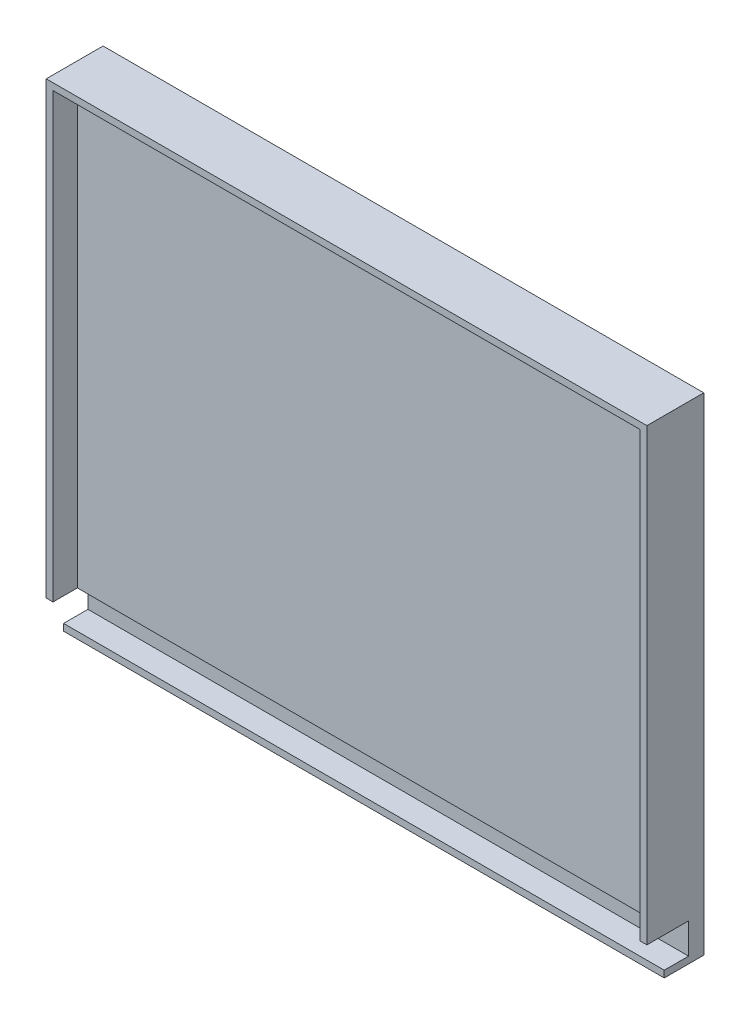
ISO-10303-21;
HEADER;
FILE_DESCRIPTION(('STEP AP214'),'2;1');
FILE_NAME('part.step','',(''),(''),'','','');
FILE_SCHEMA(('AUTOMOTIVE_DESIGN { 1 0 10303 214 1 1 1 1 }'));
ENDSEC;
DATA;
#1=APPLICATION_CONTEXT('core data for automotive mechanical design processes');
#2=APPLICATION_PROTOCOL_DEFINITION('international standard','automotive_design',2000,#1);
#3=PRODUCT_CONTEXT('',#1,'mechanical');
#4=PRODUCT('Part','Part','',(#3));
#5=PRODUCT_RELATED_PRODUCT_CATEGORY('part','',(#4));
#6=PRODUCT_DEFINITION_FORMATION('','',#4);
#7=PRODUCT_DEFINITION_CONTEXT('part definition',#1,'design');
#8=PRODUCT_DEFINITION('design','',#6,#7);
#9=PRODUCT_DEFINITION_SHAPE('','',#8);
#10=(LENGTH_UNIT() NAMED_UNIT(*) SI_UNIT(.MILLI.,.METRE.));
#11=(NAMED_UNIT(*) PLANE_ANGLE_UNIT() SI_UNIT($,.RADIAN.));
#12=(NAMED_UNIT(*) SI_UNIT($,.STERADIAN.) SOLID_ANGLE_UNIT());
#13=UNCERTAINTY_MEASURE_WITH_UNIT(LENGTH_MEASURE(1.E-05),#10,'distance_accuracy_value','');
#14=(GEOMETRIC_REPRESENTATION_CONTEXT(3) GLOBAL_UNCERTAINTY_ASSIGNED_CONTEXT((#13)) GLOBAL_UNIT_ASSIGNED_CONTEXT((#10,
#11,#12)) REPRESENTATION_CONTEXT('',''));
#15=CARTESIAN_POINT('',(0.,0.,0.));
#16=DIRECTION('',(0.,0.,1.));
#17=DIRECTION('',(1.,0.,0.));
#18=AXIS2_PLACEMENT_3D('',#15,#16,#17);
#19=CARTESIAN_POINT('',(-68.3631707317073,-94.7853658536585,17.272));
#20=DIRECTION('',(-1.,0.,0.));
#21=DIRECTION('',(0.,0.,1.));
#22=AXIS2_PLACEMENT_3D('',#19,#20,#21);
#23=PLANE('',#22);
#24=DIRECTION('',(0.,0.,-1.));
#25=VECTOR('',#24,1.);
#26=CARTESIAN_POINT('',(-68.3631707317073,-97.9603658536585,17.272));
#27=LINE('',#26,#25);
#28=CARTESIAN_POINT('',(-68.3631707317073,-97.9603658536585,18.542));
#29=VERTEX_POINT('',#28);
#30=CARTESIAN_POINT('',(-68.3631707317073,-97.9603658536585,0.));
#31=VERTEX_POINT('',#30);
#32=EDGE_CURVE('E197',#29,#31,#27,.T.);
#33=ORIENTED_EDGE('',*,*,#32,.F.);
#34=DIRECTION('',(0.,-1.,0.));
#35=VECTOR('',#34,1.);
#36=CARTESIAN_POINT('',(-68.3631707317073,-94.7853658536585,18.542));
#37=LINE('',#36,#35);
#38=CARTESIAN_POINT('',(-68.3631707317073,-94.7853658536585,18.542));
#39=VERTEX_POINT('',#38);
#40=EDGE_CURVE('E110',#39,#29,#37,.T.);
#41=ORIENTED_EDGE('',*,*,#40,.F.);
#42=DIRECTION('',(0.,0.,-1.));
#43=VECTOR('',#42,1.);
#44=CARTESIAN_POINT('',(-68.3631707317073,-94.7853658536585,17.272));
#45=LINE('',#44,#43);
#46=CARTESIAN_POINT('',(-68.3631707317073,-94.7853658536585,7.112));
#47=VERTEX_POINT('',#46);
#48=EDGE_CURVE('E194',#39,#47,#45,.T.);
#49=ORIENTED_EDGE('',*,*,#48,.T.);
#50=DIRECTION('',(0.,-1.,0.));
#51=VECTOR('',#50,1.);
#52=CARTESIAN_POINT('',(-68.3631707317073,-94.7853658536585,7.112));
#53=LINE('',#52,#51);
#54=CARTESIAN_POINT('',(-68.3631707317074,-80.4343658536585,7.112));
#55=VERTEX_POINT('',#54);
#56=EDGE_CURVE('E601',#55,#47,#53,.T.);
#57=ORIENTED_EDGE('',*,*,#56,.F.);
#58=DIRECTION('',(0.,0.,1.));
#59=VECTOR('',#58,1.);
#60=CARTESIAN_POINT('',(-68.3631707317074,-80.4343658536585,17.272));
#61=LINE('',#60,#59);
#62=CARTESIAN_POINT('',(-68.3631707317073,-80.4343658536585,26.67));
#63=VERTEX_POINT('',#62);
#64=EDGE_CURVE('E594',#55,#63,#61,.T.);
#65=ORIENTED_EDGE('',*,*,#64,.T.);
#66=DIRECTION('',(0.,-1.,0.));
#67=VECTOR('',#66,1.);
#68=CARTESIAN_POINT('',(-68.3631707317074,130.639634146342,26.67));
#69=LINE('',#68,#67);
#70=CARTESIAN_POINT('',(-68.3631707317074,130.639634146342,26.67));
#71=VERTEX_POINT('',#70);
#72=EDGE_CURVE('E582',#71,#63,#69,.T.);
#73=ORIENTED_EDGE('',*,*,#72,.F.);
#74=DIRECTION('',(0.,0.,-1.));
#75=VECTOR('',#74,1.);
#76=CARTESIAN_POINT('',(-68.3631707317074,130.639634146342,25.4));
#77=LINE('',#76,#75);
#78=CARTESIAN_POINT('',(-68.3631707317074,130.639634146342,0.));
#79=VERTEX_POINT('',#78);
#80=EDGE_CURVE('E627',#71,#79,#77,.T.);
#81=ORIENTED_EDGE('',*,*,#80,.T.);
#82=DIRECTION('',(0.,-1.,0.));
#83=VECTOR('',#82,1.);
#84=CARTESIAN_POINT('',(-68.3631707317074,130.639634146342,0.));
#85=LINE('',#84,#83);
#86=EDGE_CURVE('E603',#79,#31,#85,.T.);
#87=ORIENTED_EDGE('',*,*,#86,.T.);
#88=EDGE_LOOP('',(#33,#41,#49,#57,#65,#73,#81,#87));
#89=FACE_BOUND('',#88,.T.);
#90=ADVANCED_FACE('F43',(#89),#23,.T.);
#91=CARTESIAN_POINT('',(213.576829268293,-94.7853658536585,28.702));
#92=DIRECTION('',(1.,0.,0.));
#93=DIRECTION('',(0.,0.,-1.));
#94=AXIS2_PLACEMENT_3D('',#91,#92,#93);
#95=PLANE('',#94);
#96=DIRECTION('',(0.,0.,1.));
#97=VECTOR('',#96,1.);
#98=CARTESIAN_POINT('',(213.576829268293,-94.7853658536585,28.702));
#99=LINE('',#98,#97);
#100=CARTESIAN_POINT('',(213.576829268293,-94.7853658536585,7.112));
#101=VERTEX_POINT('',#100);
#102=CARTESIAN_POINT('',(213.576829268293,-94.7853658536585,18.542));
#103=VERTEX_POINT('',#102);
#104=EDGE_CURVE('E206',#101,#103,#99,.T.);
#105=ORIENTED_EDGE('',*,*,#104,.T.);
#106=DIRECTION('',(0.,1.,0.));
#107=VECTOR('',#106,1.);
#108=CARTESIAN_POINT('',(213.576829268293,-97.9603658536585,18.542));
#109=LINE('',#108,#107);
#110=CARTESIAN_POINT('',(213.576829268293,-97.9603658536585,18.542));
#111=VERTEX_POINT('',#110);
#112=EDGE_CURVE('E185',#111,#103,#109,.T.);
#113=ORIENTED_EDGE('',*,*,#112,.F.);
#114=DIRECTION('',(0.,0.,1.));
#115=VECTOR('',#114,1.);
#116=CARTESIAN_POINT('',(213.576829268293,-97.9603658536585,28.702));
#117=LINE('',#116,#115);
#118=CARTESIAN_POINT('',(213.576829268293,-97.9603658536585,0.));
#119=VERTEX_POINT('',#118);
#120=EDGE_CURVE('E213',#119,#111,#117,.T.);
#121=ORIENTED_EDGE('',*,*,#120,.F.);
#122=DIRECTION('',(0.,1.,0.));
#123=VECTOR('',#122,1.);
#124=CARTESIAN_POINT('',(213.576829268293,130.639634146342,0.));
#125=LINE('',#124,#123);
#126=CARTESIAN_POINT('',(213.576829268293,130.639634146342,0.));
#127=VERTEX_POINT('',#126);
#128=EDGE_CURVE('E619',#119,#127,#125,.T.);
#129=ORIENTED_EDGE('',*,*,#128,.T.);
#130=DIRECTION('',(0.,0.,-1.));
#131=VECTOR('',#130,1.);
#132=CARTESIAN_POINT('',(213.576829268293,130.639634146342,25.4));
#133=LINE('',#132,#131);
#134=CARTESIAN_POINT('',(213.576829268293,130.639634146342,26.67));
#135=VERTEX_POINT('',#134);
#136=EDGE_CURVE('E217',#135,#127,#133,.T.);
#137=ORIENTED_EDGE('',*,*,#136,.F.);
#138=DIRECTION('',(0.,1.,0.));
#139=VECTOR('',#138,1.);
#140=CARTESIAN_POINT('',(213.576829268293,-80.4343658536585,26.67));
#141=LINE('',#140,#139);
#142=CARTESIAN_POINT('',(213.576829268293,-80.4343658536585,26.67));
#143=VERTEX_POINT('',#142);
#144=EDGE_CURVE('E651',#143,#135,#141,.T.);
#145=ORIENTED_EDGE('',*,*,#144,.F.);
#146=DIRECTION('',(0.,0.,1.));
#147=VECTOR('',#146,1.);
#148=CARTESIAN_POINT('',(213.576829268293,-80.4343658536585,17.272));
#149=LINE('',#148,#147);
#150=CARTESIAN_POINT('',(213.576829268293,-80.4343658536585,7.112));
#151=VERTEX_POINT('',#150);
#152=EDGE_CURVE('E604',#151,#143,#149,.T.);
#153=ORIENTED_EDGE('',*,*,#152,.F.);
#154=DIRECTION('',(0.,1.,0.));
#155=VECTOR('',#154,1.);
#156=CARTESIAN_POINT('',(213.576829268293,-80.4343658536585,7.112));
#157=LINE('',#156,#155);
#158=EDGE_CURVE('E679',#101,#151,#157,.T.);
#159=ORIENTED_EDGE('',*,*,#158,.F.);
#160=EDGE_LOOP('',(#105,#113,#121,#129,#137,#145,#153,#159));
#161=FACE_BOUND('',#160,.T.);
#162=ADVANCED_FACE('F308',(#161),#95,.T.);
#163=CARTESIAN_POINT('',(0.,-94.7853658536585,0.));
#164=DIRECTION('',(0.,1.,0.));
#165=DIRECTION('',(0.,0.,1.));
#166=AXIS2_PLACEMENT_3D('',#163,#164,#165);
#167=PLANE('',#166);
#168=ORIENTED_EDGE('',*,*,#48,.F.);
#169=DIRECTION('',(-1.,0.,0.));
#170=VECTOR('',#169,1.);
#171=CARTESIAN_POINT('',(213.576829268293,-94.7853658536585,18.542));
#172=LINE('',#171,#170);
#173=EDGE_CURVE('E182',#103,#39,#172,.T.);
#174=ORIENTED_EDGE('',*,*,#173,.F.);
#175=ORIENTED_EDGE('',*,*,#104,.F.);
#176=DIRECTION('',(1.,0.,0.));
#177=VECTOR('',#176,1.);
#178=CARTESIAN_POINT('',(213.576829268293,-94.7853658536585,7.112));
#179=LINE('',#178,#177);
#180=EDGE_CURVE('E203',#47,#101,#179,.T.);
#181=ORIENTED_EDGE('',*,*,#180,.F.);
#182=EDGE_LOOP('',(#168,#174,#175,#181));
#183=FACE_BOUND('',#182,.T.);
#184=ADVANCED_FACE('F201',(#183),#167,.T.);
#185=CARTESIAN_POINT('',(0.,-97.9603658536585,0.));
#186=DIRECTION('',(0.,1.,0.));
#187=DIRECTION('',(0.,0.,1.));
#188=AXIS2_PLACEMENT_3D('',#185,#186,#187);
#189=PLANE('',#188);
#190=DIRECTION('',(1.,0.,0.));
#191=VECTOR('',#190,1.);
#192=CARTESIAN_POINT('',(-68.3631707317073,-97.9603658536585,18.542));
#193=LINE('',#192,#191);
#194=EDGE_CURVE('E199',#29,#111,#193,.T.);
#195=ORIENTED_EDGE('',*,*,#194,.F.);
#196=ORIENTED_EDGE('',*,*,#32,.T.);
#197=DIRECTION('',(1.,0.,0.));
#198=VECTOR('',#197,1.);
#199=CARTESIAN_POINT('',(-68.3631707317073,-97.9603658536585,0.));
#200=LINE('',#199,#198);
#201=EDGE_CURVE('E608',#31,#119,#200,.T.);
#202=ORIENTED_EDGE('',*,*,#201,.T.);
#203=ORIENTED_EDGE('',*,*,#120,.T.);
#204=EDGE_LOOP('',(#195,#196,#202,#203));
#205=FACE_BOUND('',#204,.T.);
#206=ADVANCED_FACE('F314',(#205),#189,.F.);
#207=CARTESIAN_POINT('',(-68.3631707317074,130.639634146342,25.4));
#208=DIRECTION('',(0.,-1.,0.));
#209=DIRECTION('',(1.,0.,0.));
#210=AXIS2_PLACEMENT_3D('',#207,#208,#209);
#211=PLANE('',#210);
#212=DIRECTION('',(-1.,0.,0.));
#213=VECTOR('',#212,1.);
#214=CARTESIAN_POINT('',(213.576829268293,130.639634146342,26.67));
#215=LINE('',#214,#213);
#216=EDGE_CURVE('E587',#135,#71,#215,.T.);
#217=ORIENTED_EDGE('',*,*,#216,.F.);
#218=ORIENTED_EDGE('',*,*,#136,.T.);
#219=DIRECTION('',(-1.,0.,0.));
#220=VECTOR('',#219,1.);
#221=CARTESIAN_POINT('',(-68.3631707317074,130.639634146342,0.));
#222=LINE('',#221,#220);
#223=EDGE_CURVE('E623',#127,#79,#222,.T.);
#224=ORIENTED_EDGE('',*,*,#223,.T.);
#225=ORIENTED_EDGE('',*,*,#80,.F.);
#226=EDGE_LOOP('',(#217,#218,#224,#225));
#227=FACE_BOUND('',#226,.T.);
#228=ADVANCED_FACE('F317',(#227),#211,.F.);
#229=CARTESIAN_POINT('',(-68.3631707317074,-80.4343658536585,17.272));
#230=DIRECTION('',(0.,1.,0.));
#231=DIRECTION('',(0.,0.,1.));
#232=AXIS2_PLACEMENT_3D('',#229,#230,#231);
#233=PLANE('',#232);
#234=DIRECTION('',(1.,0.,0.));
#235=VECTOR('',#234,1.);
#236=CARTESIAN_POINT('',(-68.3631707317073,-80.4343658536585,26.67));
#237=LINE('',#236,#235);
#238=CARTESIAN_POINT('',(-65.1881707317073,-80.4343658536585,26.67));
#239=VERTEX_POINT('',#238);
#240=EDGE_CURVE('E584',#63,#239,#237,.T.);
#241=ORIENTED_EDGE('',*,*,#240,.F.);
#242=ORIENTED_EDGE('',*,*,#64,.F.);
#243=DIRECTION('',(-1.,0.,0.));
#244=VECTOR('',#243,1.);
#245=CARTESIAN_POINT('',(-68.3631707317074,-80.4343658536585,7.112));
#246=LINE('',#245,#244);
#247=EDGE_CURVE('E672',#151,#55,#246,.T.);
#248=ORIENTED_EDGE('',*,*,#247,.F.);
#249=ORIENTED_EDGE('',*,*,#152,.T.);
#250=DIRECTION('',(1.,0.,0.));
#251=VECTOR('',#250,1.);
#252=CARTESIAN_POINT('',(210.401829268293,-80.4343658536585,26.67));
#253=LINE('',#252,#251);
#254=CARTESIAN_POINT('',(210.401829268293,-80.4343658536585,26.67));
#255=VERTEX_POINT('',#254);
#256=EDGE_CURVE('E648',#255,#143,#253,.T.);
#257=ORIENTED_EDGE('',*,*,#256,.F.);
#258=DIRECTION('',(0.,0.,-1.));
#259=VECTOR('',#258,1.);
#260=CARTESIAN_POINT('',(210.401829268293,-80.4343658536585,25.4));
#261=LINE('',#260,#259);
#262=CARTESIAN_POINT('',(210.401829268293,-80.4343658536585,15.24));
#263=VERTEX_POINT('',#262);
#264=EDGE_CURVE('E687',#255,#263,#261,.T.);
#265=ORIENTED_EDGE('',*,*,#264,.T.);
#266=DIRECTION('',(1.,0.,0.));
#267=VECTOR('',#266,1.);
#268=CARTESIAN_POINT('',(210.401829268293,-80.4343658536585,15.24));
#269=LINE('',#268,#267);
#270=CARTESIAN_POINT('',(-65.1881707317073,-80.4343658536585,15.24));
#271=VERTEX_POINT('',#270);
#272=EDGE_CURVE('E664',#271,#263,#269,.T.);
#273=ORIENTED_EDGE('',*,*,#272,.F.);
#274=DIRECTION('',(0.,0.,1.));
#275=VECTOR('',#274,1.);
#276=CARTESIAN_POINT('',(-65.1881707317073,-80.4343658536585,36.83));
#277=LINE('',#276,#275);
#278=EDGE_CURVE('E597',#271,#239,#277,.T.);
#279=ORIENTED_EDGE('',*,*,#278,.T.);
#280=EDGE_LOOP('',(#241,#242,#248,#249,#257,#265,#273,#279));
#281=FACE_BOUND('',#280,.T.);
#282=ADVANCED_FACE('F323',(#281),#233,.F.);
#283=CARTESIAN_POINT('',(0.,127.464634146342,0.));
#284=DIRECTION('',(0.,-1.,0.));
#285=DIRECTION('',(1.,0.,0.));
#286=AXIS2_PLACEMENT_3D('',#283,#284,#285);
#287=PLANE('',#286);
#288=DIRECTION('',(0.,0.,1.));
#289=VECTOR('',#288,1.);
#290=CARTESIAN_POINT('',(210.401829268293,127.464634146342,36.83));
#291=LINE('',#290,#289);
#292=CARTESIAN_POINT('',(210.401829268293,127.464634146342,15.24));
#293=VERTEX_POINT('',#292);
#294=CARTESIAN_POINT('',(210.401829268293,127.464634146342,26.67));
#295=VERTEX_POINT('',#294);
#296=EDGE_CURVE('E683',#293,#295,#291,.T.);
#297=ORIENTED_EDGE('',*,*,#296,.T.);
#298=DIRECTION('',(1.,0.,0.));
#299=VECTOR('',#298,1.);
#300=CARTESIAN_POINT('',(-65.1881707317074,127.464634146342,26.67));
#301=LINE('',#300,#299);
#302=CARTESIAN_POINT('',(-65.1881707317074,127.464634146342,26.67));
#303=VERTEX_POINT('',#302);
#304=EDGE_CURVE('E118',#303,#295,#301,.T.);
#305=ORIENTED_EDGE('',*,*,#304,.F.);
#306=DIRECTION('',(0.,0.,1.));
#307=VECTOR('',#306,1.);
#308=CARTESIAN_POINT('',(-65.1881707317074,127.464634146342,36.83));
#309=LINE('',#308,#307);
#310=CARTESIAN_POINT('',(-65.1881707317074,127.464634146342,15.24));
#311=VERTEX_POINT('',#310);
#312=EDGE_CURVE('E611',#311,#303,#309,.T.);
#313=ORIENTED_EDGE('',*,*,#312,.F.);
#314=DIRECTION('',(-1.,0.,0.));
#315=VECTOR('',#314,1.);
#316=CARTESIAN_POINT('',(-65.1881707317074,127.464634146342,15.24));
#317=LINE('',#316,#315);
#318=EDGE_CURVE('E656',#293,#311,#317,.T.);
#319=ORIENTED_EDGE('',*,*,#318,.F.);
#320=EDGE_LOOP('',(#297,#305,#313,#319));
#321=FACE_BOUND('',#320,.T.);
#322=ADVANCED_FACE('F333',(#321),#287,.T.);
#323=CARTESIAN_POINT('',(-65.1881707317074,0.,0.));
#324=DIRECTION('',(1.,0.,0.));
#325=DIRECTION('',(0.,1.,0.));
#326=AXIS2_PLACEMENT_3D('',#323,#324,#325);
#327=PLANE('',#326);
#328=ORIENTED_EDGE('',*,*,#312,.T.);
#329=DIRECTION('',(0.,1.,0.));
#330=VECTOR('',#329,1.);
#331=CARTESIAN_POINT('',(-65.1881707317073,-80.4343658536585,26.67));
#332=LINE('',#331,#330);
#333=EDGE_CURVE('E599',#239,#303,#332,.T.);
#334=ORIENTED_EDGE('',*,*,#333,.F.);
#335=ORIENTED_EDGE('',*,*,#278,.F.);
#336=DIRECTION('',(0.,-1.,0.));
#337=VECTOR('',#336,1.);
#338=CARTESIAN_POINT('',(-65.1881707317073,-80.4343658536585,15.24));
#339=LINE('',#338,#337);
#340=EDGE_CURVE('E660',#311,#271,#339,.T.);
#341=ORIENTED_EDGE('',*,*,#340,.F.);
#342=EDGE_LOOP('',(#328,#334,#335,#341));
#343=FACE_BOUND('',#342,.T.);
#344=ADVANCED_FACE('F337',(#343),#327,.T.);
#345=CARTESIAN_POINT('',(210.401829268293,0.,0.));
#346=DIRECTION('',(-1.,0.,0.));
#347=DIRECTION('',(0.,0.,1.));
#348=AXIS2_PLACEMENT_3D('',#345,#346,#347);
#349=PLANE('',#348);
#350=ORIENTED_EDGE('',*,*,#264,.F.);
#351=DIRECTION('',(0.,-1.,0.));
#352=VECTOR('',#351,1.);
#353=CARTESIAN_POINT('',(210.401829268293,127.464634146342,26.67));
#354=LINE('',#353,#352);
#355=EDGE_CURVE('E645',#295,#255,#354,.T.);
#356=ORIENTED_EDGE('',*,*,#355,.F.);
#357=ORIENTED_EDGE('',*,*,#296,.F.);
#358=DIRECTION('',(0.,1.,0.));
#359=VECTOR('',#358,1.);
#360=CARTESIAN_POINT('',(210.401829268293,127.464634146342,15.24));
#361=LINE('',#360,#359);
#362=EDGE_CURVE('E668',#263,#293,#361,.T.);
#363=ORIENTED_EDGE('',*,*,#362,.F.);
#364=EDGE_LOOP('',(#350,#356,#357,#363));
#365=FACE_BOUND('',#364,.T.);
#366=ADVANCED_FACE('F329',(#365),#349,.T.);
#367=CARTESIAN_POINT('',(0.,0.,0.));
#368=DIRECTION('',(0.,0.,1.));
#369=DIRECTION('',(1.,0.,0.));
#370=AXIS2_PLACEMENT_3D('',#367,#368,#369);
#371=PLANE('',#370);
#372=ORIENTED_EDGE('',*,*,#86,.F.);
#373=ORIENTED_EDGE('',*,*,#223,.F.);
#374=ORIENTED_EDGE('',*,*,#128,.F.);
#375=ORIENTED_EDGE('',*,*,#201,.F.);
#376=EDGE_LOOP('',(#372,#373,#374,#375));
#377=FACE_BOUND('',#376,.T.);
#378=ADVANCED_FACE('F325',(#377),#371,.F.);
#379=CARTESIAN_POINT('',(0.,0.,7.112));
#380=DIRECTION('',(0.,0.,-1.));
#381=DIRECTION('',(-1.,0.,0.));
#382=AXIS2_PLACEMENT_3D('',#379,#380,#381);
#383=PLANE('',#382);
#384=ORIENTED_EDGE('',*,*,#247,.T.);
#385=ORIENTED_EDGE('',*,*,#56,.T.);
#386=ORIENTED_EDGE('',*,*,#180,.T.);
#387=ORIENTED_EDGE('',*,*,#158,.T.);
#388=EDGE_LOOP('',(#384,#385,#386,#387));
#389=FACE_BOUND('',#388,.T.);
#390=ADVANCED_FACE('F328',(#389),#383,.F.);
#391=CARTESIAN_POINT('',(0.,0.,15.24));
#392=DIRECTION('',(0.,0.,-1.));
#393=DIRECTION('',(-1.,0.,0.));
#394=AXIS2_PLACEMENT_3D('',#391,#392,#393);
#395=PLANE('',#394);
#396=ORIENTED_EDGE('',*,*,#318,.T.);
#397=ORIENTED_EDGE('',*,*,#340,.T.);
#398=ORIENTED_EDGE('',*,*,#272,.T.);
#399=ORIENTED_EDGE('',*,*,#362,.T.);
#400=EDGE_LOOP('',(#396,#397,#398,#399));
#401=FACE_BOUND('',#400,.T.);
#402=ADVANCED_FACE('F347',(#401),#395,.F.);
#403=CARTESIAN_POINT('',(0.,0.,26.67));
#404=DIRECTION('',(0.,0.,1.));
#405=DIRECTION('',(1.,0.,0.));
#406=AXIS2_PLACEMENT_3D('',#403,#404,#405);
#407=PLANE('',#406);
#408=ORIENTED_EDGE('',*,*,#72,.T.);
#409=ORIENTED_EDGE('',*,*,#240,.T.);
#410=ORIENTED_EDGE('',*,*,#333,.T.);
#411=ORIENTED_EDGE('',*,*,#304,.T.);
#412=ORIENTED_EDGE('',*,*,#355,.T.);
#413=ORIENTED_EDGE('',*,*,#256,.T.);
#414=ORIENTED_EDGE('',*,*,#144,.T.);
#415=ORIENTED_EDGE('',*,*,#216,.T.);
#416=EDGE_LOOP('',(#408,#409,#410,#411,#412,#413,#414,#415));
#417=FACE_BOUND('',#416,.T.);
#418=ADVANCED_FACE('F351',(#417),#407,.T.);
#419=CARTESIAN_POINT('',(0.,0.,18.542));
#420=DIRECTION('',(0.,0.,1.));
#421=DIRECTION('',(1.,0.,0.));
#422=AXIS2_PLACEMENT_3D('',#419,#420,#421);
#423=PLANE('',#422);
#424=ORIENTED_EDGE('',*,*,#173,.T.);
#425=ORIENTED_EDGE('',*,*,#40,.T.);
#426=ORIENTED_EDGE('',*,*,#194,.T.);
#427=ORIENTED_EDGE('',*,*,#112,.T.);
#428=EDGE_LOOP('',(#424,#425,#426,#427));
#429=FACE_BOUND('',#428,.T.);
#430=ADVANCED_FACE('F183',(#429),#423,.T.);
#431=CLOSED_SHELL('',(#90,#162,#184,#206,#228,#282,#322,#344,#366,#378,#390,#402,#418,#430));
#432=CARTESIAN_POINT('',(-65.8231707317073,-94.7853658536585,17.272));
#433=DIRECTION('',(-1.,0.,0.));
#434=DIRECTION('',(0.,0.,1.));
#435=AXIS2_PLACEMENT_3D('',#432,#433,#434);
#436=PLANE('',#435);
#437=DIRECTION('',(0.,0.,1.));
#438=VECTOR('',#437,1.);
#439=CARTESIAN_POINT('',(-65.8231707317073,-77.8943658536585,17.272));
#440=LINE('',#439,#438);
#441=CARTESIAN_POINT('',(-65.8231707317073,-77.8943658536585,4.572));
#442=VERTEX_POINT('',#441);
#443=CARTESIAN_POINT('',(-65.8231707317073,-77.8943658536585,12.7));
#444=VERTEX_POINT('',#443);
#445=EDGE_CURVE('E47',#442,#444,#440,.T.);
#446=ORIENTED_EDGE('',*,*,#445,.F.);
#447=DIRECTION('',(0.,-1.,0.));
#448=VECTOR('',#447,1.);
#449=CARTESIAN_POINT('',(-65.8231707317073,-94.7853658536585,4.572));
#450=LINE('',#449,#448);
#451=CARTESIAN_POINT('',(-65.8231707317073,-95.4203658536585,4.572));
#452=VERTEX_POINT('',#451);
#453=EDGE_CURVE('E222',#442,#452,#450,.T.);
#454=ORIENTED_EDGE('',*,*,#453,.T.);
#455=DIRECTION('',(0.,0.,-1.));
#456=VECTOR('',#455,1.);
#457=CARTESIAN_POINT('',(-65.8231707317073,-95.4203658536585,17.272));
#458=LINE('',#457,#456);
#459=CARTESIAN_POINT('',(-65.8231707317073,-95.4203658536585,2.54));
#460=VERTEX_POINT('',#459);
#461=EDGE_CURVE('E248',#452,#460,#458,.T.);
#462=ORIENTED_EDGE('',*,*,#461,.T.);
#463=DIRECTION('',(0.,-1.,0.));
#464=VECTOR('',#463,1.);
#465=CARTESIAN_POINT('',(-65.8231707317073,0.,2.54));
#466=LINE('',#465,#464);
#467=CARTESIAN_POINT('',(-65.8231707317073,128.099634146342,2.54));
#468=VERTEX_POINT('',#467);
#469=EDGE_CURVE('E265',#468,#460,#466,.T.);
#470=ORIENTED_EDGE('',*,*,#469,.F.);
#471=DIRECTION('',(0.,0.,-1.));
#472=VECTOR('',#471,1.);
#473=CARTESIAN_POINT('',(-65.8231707317073,128.099634146342,25.4));
#474=LINE('',#473,#472);
#475=CARTESIAN_POINT('',(-65.8231707317073,128.099634146342,12.7));
#476=VERTEX_POINT('',#475);
#477=EDGE_CURVE('E99',#476,#468,#474,.T.);
#478=ORIENTED_EDGE('',*,*,#477,.F.);
#479=DIRECTION('',(0.,1.,0.));
#480=VECTOR('',#479,1.);
#481=CARTESIAN_POINT('',(-65.8231707317073,0.,12.7));
#482=LINE('',#481,#480);
#483=EDGE_CURVE('E64',#444,#476,#482,.T.);
#484=ORIENTED_EDGE('',*,*,#483,.F.);
#485=EDGE_LOOP('',(#446,#454,#462,#470,#478,#484));
#486=FACE_BOUND('',#485,.T.);
#487=ADVANCED_FACE('F276',(#486),#436,.F.);
#488=CARTESIAN_POINT('',(211.036829268293,-94.7853658536585,28.702));
#489=DIRECTION('',(1.,0.,0.));
#490=DIRECTION('',(0.,0.,-1.));
#491=AXIS2_PLACEMENT_3D('',#488,#489,#490);
#492=PLANE('',#491);
#493=DIRECTION('',(0.,0.,-1.));
#494=VECTOR('',#493,1.);
#495=CARTESIAN_POINT('',(211.036829268293,128.099634146342,28.702));
#496=LINE('',#495,#494);
#497=CARTESIAN_POINT('',(211.036829268293,128.099634146342,12.7));
#498=VERTEX_POINT('',#497);
#499=CARTESIAN_POINT('',(211.036829268293,128.099634146342,2.54));
#500=VERTEX_POINT('',#499);
#501=EDGE_CURVE('E241',#498,#500,#496,.T.);
#502=ORIENTED_EDGE('',*,*,#501,.T.);
#503=DIRECTION('',(0.,1.,0.));
#504=VECTOR('',#503,1.);
#505=CARTESIAN_POINT('',(211.036829268293,0.,2.54));
#506=LINE('',#505,#504);
#507=CARTESIAN_POINT('',(211.036829268293,-95.4203658536585,2.54));
#508=VERTEX_POINT('',#507);
#509=EDGE_CURVE('E258',#508,#500,#506,.T.);
#510=ORIENTED_EDGE('',*,*,#509,.F.);
#511=DIRECTION('',(0.,0.,1.));
#512=VECTOR('',#511,1.);
#513=CARTESIAN_POINT('',(211.036829268293,-95.4203658536585,28.702));
#514=LINE('',#513,#512);
#515=CARTESIAN_POINT('',(211.036829268293,-95.4203658536585,4.572));
#516=VERTEX_POINT('',#515);
#517=EDGE_CURVE('E254',#508,#516,#514,.T.);
#518=ORIENTED_EDGE('',*,*,#517,.T.);
#519=DIRECTION('',(0.,1.,0.));
#520=VECTOR('',#519,1.);
#521=CARTESIAN_POINT('',(211.036829268293,-94.7853658536585,4.572));
#522=LINE('',#521,#520);
#523=CARTESIAN_POINT('',(211.036829268293,-77.8943658536585,4.572));
#524=VERTEX_POINT('',#523);
#525=EDGE_CURVE('E230',#516,#524,#522,.T.);
#526=ORIENTED_EDGE('',*,*,#525,.T.);
#527=DIRECTION('',(0.,0.,1.));
#528=VECTOR('',#527,1.);
#529=CARTESIAN_POINT('',(211.036829268293,-77.8943658536585,28.702));
#530=LINE('',#529,#528);
#531=CARTESIAN_POINT('',(211.036829268293,-77.8943658536585,12.7));
#532=VERTEX_POINT('',#531);
#533=EDGE_CURVE('E234',#524,#532,#530,.T.);
#534=ORIENTED_EDGE('',*,*,#533,.T.);
#535=DIRECTION('',(0.,-1.,0.));
#536=VECTOR('',#535,1.);
#537=CARTESIAN_POINT('',(211.036829268293,0.,12.7));
#538=LINE('',#537,#536);
#539=EDGE_CURVE('E262',#498,#532,#538,.T.);
#540=ORIENTED_EDGE('',*,*,#539,.F.);
#541=EDGE_LOOP('',(#502,#510,#518,#526,#534,#540));
#542=FACE_BOUND('',#541,.T.);
#543=ADVANCED_FACE('F283',(#542),#492,.F.);
#544=CARTESIAN_POINT('',(0.,-95.4203658536585,0.));
#545=DIRECTION('',(0.,1.,0.));
#546=DIRECTION('',(0.,0.,1.));
#547=AXIS2_PLACEMENT_3D('',#544,#545,#546);
#548=PLANE('',#547);
#549=ORIENTED_EDGE('',*,*,#517,.F.);
#550=DIRECTION('',(1.,0.,0.));
#551=VECTOR('',#550,1.);
#552=CARTESIAN_POINT('',(0.,-95.4203658536585,2.54));
#553=LINE('',#552,#551);
#554=EDGE_CURVE('E244',#460,#508,#553,.T.);
#555=ORIENTED_EDGE('',*,*,#554,.F.);
#556=ORIENTED_EDGE('',*,*,#461,.F.);
#557=DIRECTION('',(-1.,0.,0.));
#558=VECTOR('',#557,1.);
#559=CARTESIAN_POINT('',(0.,-95.4203658536585,4.572));
#560=LINE('',#559,#558);
#561=EDGE_CURVE('E251',#516,#452,#560,.T.);
#562=ORIENTED_EDGE('',*,*,#561,.F.);
#563=EDGE_LOOP('',(#549,#555,#556,#562));
#564=FACE_BOUND('',#563,.T.);
#565=ADVANCED_FACE('F280',(#564),#548,.T.);
#566=CARTESIAN_POINT('',(-68.3631707317074,128.099634146342,25.4));
#567=DIRECTION('',(0.,-1.,0.));
#568=DIRECTION('',(1.,0.,0.));
#569=AXIS2_PLACEMENT_3D('',#566,#567,#568);
#570=PLANE('',#569);
#571=DIRECTION('',(-1.,0.,0.));
#572=VECTOR('',#571,1.);
#573=CARTESIAN_POINT('',(0.,128.099634146342,12.7));
#574=LINE('',#573,#572);
#575=EDGE_CURVE('E55',#498,#476,#574,.T.);
#576=ORIENTED_EDGE('',*,*,#575,.T.);
#577=ORIENTED_EDGE('',*,*,#477,.T.);
#578=DIRECTION('',(-1.,0.,0.));
#579=VECTOR('',#578,1.);
#580=CARTESIAN_POINT('',(-68.3631707317074,128.099634146342,2.54));
#581=LINE('',#580,#579);
#582=EDGE_CURVE('E238',#500,#468,#581,.T.);
#583=ORIENTED_EDGE('',*,*,#582,.F.);
#584=ORIENTED_EDGE('',*,*,#501,.F.);
#585=EDGE_LOOP('',(#576,#577,#583,#584));
#586=FACE_BOUND('',#585,.T.);
#587=ADVANCED_FACE('F290',(#586),#570,.T.);
#588=CARTESIAN_POINT('',(-68.3631707317074,-77.8943658536585,17.272));
#589=DIRECTION('',(0.,1.,0.));
#590=DIRECTION('',(0.,0.,1.));
#591=AXIS2_PLACEMENT_3D('',#588,#589,#590);
#592=PLANE('',#591);
#593=DIRECTION('',(1.,0.,0.));
#594=VECTOR('',#593,1.);
#595=CARTESIAN_POINT('',(0.,-77.8943658536585,12.7));
#596=LINE('',#595,#594);
#597=EDGE_CURVE('E11',#444,#532,#596,.T.);
#598=ORIENTED_EDGE('',*,*,#597,.T.);
#599=ORIENTED_EDGE('',*,*,#533,.F.);
#600=DIRECTION('',(-1.,0.,0.));
#601=VECTOR('',#600,1.);
#602=CARTESIAN_POINT('',(-68.3631707317074,-77.8943658536585,4.572));
#603=LINE('',#602,#601);
#604=EDGE_CURVE('E226',#524,#442,#603,.T.);
#605=ORIENTED_EDGE('',*,*,#604,.T.);
#606=ORIENTED_EDGE('',*,*,#445,.T.);
#607=EDGE_LOOP('',(#598,#599,#605,#606));
#608=FACE_BOUND('',#607,.T.);
#609=ADVANCED_FACE('F288',(#608),#592,.T.);
#610=CARTESIAN_POINT('',(0.,0.,2.54));
#611=DIRECTION('',(0.,0.,1.));
#612=DIRECTION('',(1.,0.,0.));
#613=AXIS2_PLACEMENT_3D('',#610,#611,#612);
#614=PLANE('',#613);
#615=ORIENTED_EDGE('',*,*,#469,.T.);
#616=ORIENTED_EDGE('',*,*,#554,.T.);
#617=ORIENTED_EDGE('',*,*,#509,.T.);
#618=ORIENTED_EDGE('',*,*,#582,.T.);
#619=EDGE_LOOP('',(#615,#616,#617,#618));
#620=FACE_BOUND('',#619,.T.);
#621=ADVANCED_FACE('F273',(#620),#614,.T.);
#622=CARTESIAN_POINT('',(0.,0.,4.572));
#623=DIRECTION('',(0.,0.,-1.));
#624=DIRECTION('',(-1.,0.,0.));
#625=AXIS2_PLACEMENT_3D('',#622,#623,#624);
#626=PLANE('',#625);
#627=ORIENTED_EDGE('',*,*,#561,.T.);
#628=ORIENTED_EDGE('',*,*,#453,.F.);
#629=ORIENTED_EDGE('',*,*,#604,.F.);
#630=ORIENTED_EDGE('',*,*,#525,.F.);
#631=EDGE_LOOP('',(#627,#628,#629,#630));
#632=FACE_BOUND('',#631,.T.);
#633=ADVANCED_FACE('F286',(#632),#626,.T.);
#634=CARTESIAN_POINT('',(0.,0.,12.7));
#635=DIRECTION('',(0.,0.,-1.));
#636=DIRECTION('',(-1.,0.,0.));
#637=AXIS2_PLACEMENT_3D('',#634,#635,#636);
#638=PLANE('',#637);
#639=ORIENTED_EDGE('',*,*,#539,.T.);
#640=ORIENTED_EDGE('',*,*,#597,.F.);
#641=ORIENTED_EDGE('',*,*,#483,.T.);
#642=ORIENTED_EDGE('',*,*,#575,.F.);
#643=EDGE_LOOP('',(#639,#640,#641,#642));
#644=FACE_BOUND('',#643,.T.);
#645=ADVANCED_FACE('F45',(#644),#638,.T.);
#646=CLOSED_SHELL('',(#487,#543,#565,#587,#609,#621,#633,#645));
#647=ORIENTED_CLOSED_SHELL('',*,#646,.T.);
#648=BREP_WITH_VOIDS('B2',#431,(#647));
#649=ADVANCED_BREP_SHAPE_REPRESENTATION('',(#18,#648),#14);
#650=SHAPE_DEFINITION_REPRESENTATION(#9,#649);
ENDSEC;
END-ISO-10303-21;
